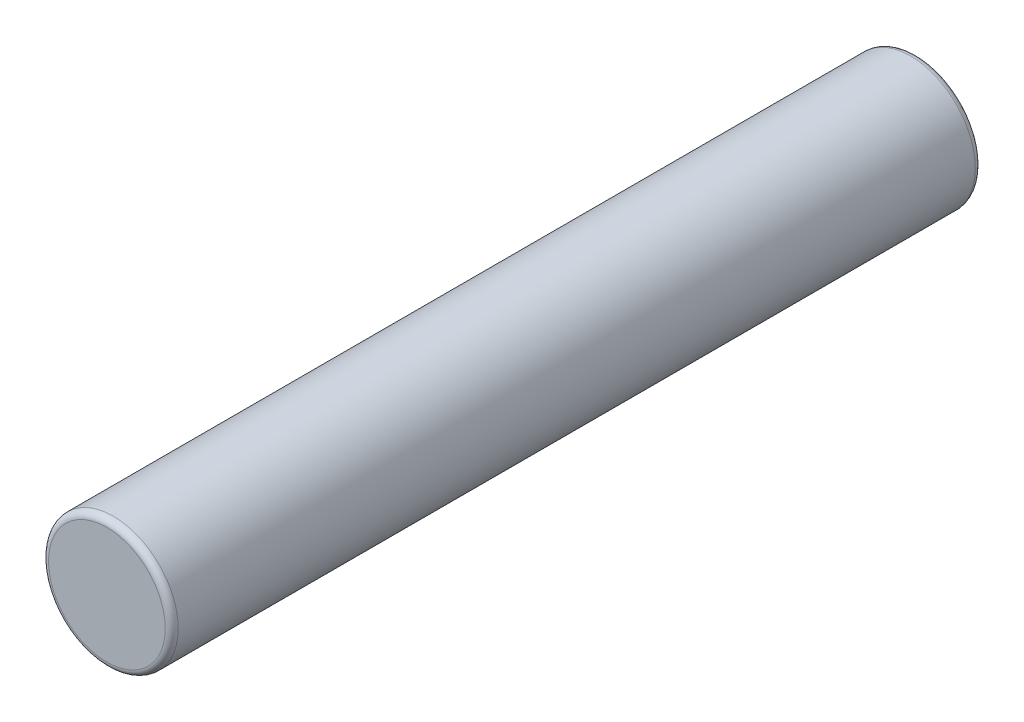
ISO-10303-21;
HEADER;
FILE_DESCRIPTION(('STEP AP214'),'2;1');
FILE_NAME('part.step','',(''),(''),'','','');
FILE_SCHEMA(('AUTOMOTIVE_DESIGN { 1 0 10303 214 1 1 1 1 }'));
ENDSEC;
DATA;
#1=APPLICATION_CONTEXT('core data for automotive mechanical design processes');
#2=APPLICATION_PROTOCOL_DEFINITION('international standard','automotive_design',2000,#1);
#3=PRODUCT_CONTEXT('',#1,'mechanical');
#4=PRODUCT('Part','Part','',(#3));
#5=PRODUCT_RELATED_PRODUCT_CATEGORY('part','',(#4));
#6=PRODUCT_DEFINITION_FORMATION('','',#4);
#7=PRODUCT_DEFINITION_CONTEXT('part definition',#1,'design');
#8=PRODUCT_DEFINITION('design','',#6,#7);
#9=PRODUCT_DEFINITION_SHAPE('','',#8);
#10=(LENGTH_UNIT() NAMED_UNIT(*) SI_UNIT(.MILLI.,.METRE.));
#11=(NAMED_UNIT(*) PLANE_ANGLE_UNIT() SI_UNIT($,.RADIAN.));
#12=(NAMED_UNIT(*) SI_UNIT($,.STERADIAN.) SOLID_ANGLE_UNIT());
#13=UNCERTAINTY_MEASURE_WITH_UNIT(LENGTH_MEASURE(1.E-05),#10,'distance_accuracy_value','');
#14=(GEOMETRIC_REPRESENTATION_CONTEXT(3) GLOBAL_UNCERTAINTY_ASSIGNED_CONTEXT((#13)) GLOBAL_UNIT_ASSIGNED_CONTEXT((#10,
#11,#12)) REPRESENTATION_CONTEXT('',''));
#15=CARTESIAN_POINT('',(0.,0.,0.));
#16=DIRECTION('',(0.,0.,1.));
#17=DIRECTION('',(1.,0.,0.));
#18=AXIS2_PLACEMENT_3D('',#15,#16,#17);
#19=CARTESIAN_POINT('',(0.,0.,25.));
#20=DIRECTION('',(0.,0.,-1.));
#21=DIRECTION('',(-1.,0.,0.));
#22=AXIS2_PLACEMENT_3D('',#19,#20,#21);
#23=CYLINDRICAL_SURFACE('',#22,2.);
#24=CARTESIAN_POINT('',(0.,0.,0.199999999999999));
#25=DIRECTION('',(0.,0.,1.));
#26=DIRECTION('',(1.,0.,0.));
#27=AXIS2_PLACEMENT_3D('',#24,#25,#26);
#28=CIRCLE('',#27,2.);
#29=CARTESIAN_POINT('',(2.,0.,0.199999999999999));
#30=VERTEX_POINT('',#29);
#31=EDGE_CURVE('E44',#30,#30,#28,.T.);
#32=ORIENTED_EDGE('',*,*,#31,.T.);
#33=EDGE_LOOP('',(#32));
#34=FACE_BOUND('',#33,.T.);
#35=CARTESIAN_POINT('',(0.,0.,24.8));
#36=DIRECTION('',(0.,0.,1.));
#37=DIRECTION('',(1.,0.,0.));
#38=AXIS2_PLACEMENT_3D('',#35,#36,#37);
#39=CIRCLE('',#38,2.);
#40=CARTESIAN_POINT('',(2.,0.,24.8));
#41=VERTEX_POINT('',#40);
#42=EDGE_CURVE('E48',#41,#41,#39,.F.);
#43=ORIENTED_EDGE('',*,*,#42,.T.);
#44=EDGE_LOOP('',(#43));
#45=FACE_BOUND('',#44,.T.);
#46=ADVANCED_FACE('F33',(#34,#45),#23,.T.);
#47=CARTESIAN_POINT('',(0.,0.,25.));
#48=DIRECTION('',(0.,0.,1.));
#49=DIRECTION('',(1.,0.,0.));
#50=AXIS2_PLACEMENT_3D('',#47,#48,#49);
#51=PLANE('',#50);
#52=CARTESIAN_POINT('',(0.,0.,25.));
#53=DIRECTION('',(0.,0.,1.));
#54=DIRECTION('',(1.,0.,0.));
#55=AXIS2_PLACEMENT_3D('',#52,#53,#54);
#56=CIRCLE('',#55,1.8);
#57=CARTESIAN_POINT('',(1.8,0.,25.));
#58=VERTEX_POINT('',#57);
#59=EDGE_CURVE('E10',#58,#58,#56,.T.);
#60=ORIENTED_EDGE('',*,*,#59,.T.);
#61=EDGE_LOOP('',(#60));
#62=FACE_BOUND('',#61,.T.);
#63=ADVANCED_FACE('F64',(#62),#51,.T.);
#64=CARTESIAN_POINT('',(0.,0.,0.));
#65=DIRECTION('',(0.,0.,1.));
#66=DIRECTION('',(1.,0.,0.));
#67=AXIS2_PLACEMENT_3D('',#64,#65,#66);
#68=PLANE('',#67);
#69=CARTESIAN_POINT('',(0.,0.,0.));
#70=DIRECTION('',(0.,0.,1.));
#71=DIRECTION('',(1.,0.,0.));
#72=AXIS2_PLACEMENT_3D('',#69,#70,#71);
#73=CIRCLE('',#72,1.8);
#74=CARTESIAN_POINT('',(1.8,0.,0.));
#75=VERTEX_POINT('',#74);
#76=EDGE_CURVE('E40',#75,#75,#73,.F.);
#77=ORIENTED_EDGE('',*,*,#76,.T.);
#78=EDGE_LOOP('',(#77));
#79=FACE_BOUND('',#78,.T.);
#80=ADVANCED_FACE('F61',(#79),#68,.F.);
#81=CARTESIAN_POINT('',(0.,0.,0.199999999999999));
#82=DIRECTION('',(0.,0.,1.));
#83=DIRECTION('',(1.,0.,0.));
#84=AXIS2_PLACEMENT_3D('',#81,#82,#83);
#85=TOROIDAL_SURFACE('',#84,1.8,0.2);
#86=ORIENTED_EDGE('',*,*,#76,.F.);
#87=EDGE_LOOP('',(#86));
#88=FACE_BOUND('',#87,.T.);
#89=ORIENTED_EDGE('',*,*,#31,.F.);
#90=EDGE_LOOP('',(#89));
#91=FACE_BOUND('',#90,.T.);
#92=ADVANCED_FACE('F57',(#88,#91),#85,.T.);
#93=CARTESIAN_POINT('',(0.,0.,24.8));
#94=DIRECTION('',(0.,0.,1.));
#95=DIRECTION('',(1.,0.,0.));
#96=AXIS2_PLACEMENT_3D('',#93,#94,#95);
#97=TOROIDAL_SURFACE('',#96,1.8,0.2);
#98=ORIENTED_EDGE('',*,*,#42,.F.);
#99=EDGE_LOOP('',(#98));
#100=FACE_BOUND('',#99,.T.);
#101=ORIENTED_EDGE('',*,*,#59,.F.);
#102=EDGE_LOOP('',(#101));
#103=FACE_BOUND('',#102,.T.);
#104=ADVANCED_FACE('F35',(#100,#103),#97,.T.);
#105=CLOSED_SHELL('',(#46,#63,#80,#92,#104));
#106=MANIFOLD_SOLID_BREP('B2',#105);
#107=ADVANCED_BREP_SHAPE_REPRESENTATION('',(#18,#106),#14);
#108=SHAPE_DEFINITION_REPRESENTATION(#9,#107);
ENDSEC;
END-ISO-10303-21;
